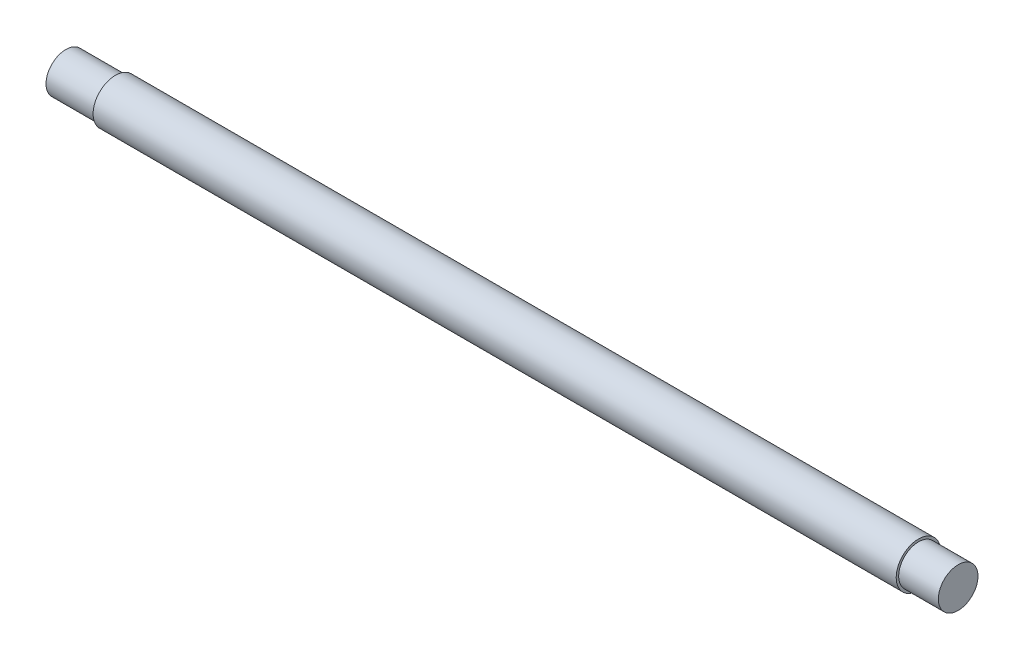
ISO-10303-21;
HEADER;
FILE_DESCRIPTION(('STEP AP214'),'2;1');
FILE_NAME('part.step','',(''),(''),'','','');
FILE_SCHEMA(('AUTOMOTIVE_DESIGN { 1 0 10303 214 1 1 1 1 }'));
ENDSEC;
DATA;
#1=APPLICATION_CONTEXT('core data for automotive mechanical design processes');
#2=APPLICATION_PROTOCOL_DEFINITION('international standard','automotive_design',2000,#1);
#3=PRODUCT_CONTEXT('',#1,'mechanical');
#4=PRODUCT('Part','Part','',(#3));
#5=PRODUCT_RELATED_PRODUCT_CATEGORY('part','',(#4));
#6=PRODUCT_DEFINITION_FORMATION('','',#4);
#7=PRODUCT_DEFINITION_CONTEXT('part definition',#1,'design');
#8=PRODUCT_DEFINITION('design','',#6,#7);
#9=PRODUCT_DEFINITION_SHAPE('','',#8);
#10=(LENGTH_UNIT() NAMED_UNIT(*) SI_UNIT(.MILLI.,.METRE.));
#11=(NAMED_UNIT(*) PLANE_ANGLE_UNIT() SI_UNIT($,.RADIAN.));
#12=(NAMED_UNIT(*) SI_UNIT($,.STERADIAN.) SOLID_ANGLE_UNIT());
#13=UNCERTAINTY_MEASURE_WITH_UNIT(LENGTH_MEASURE(1.E-05),#10,'distance_accuracy_value','');
#14=(GEOMETRIC_REPRESENTATION_CONTEXT(3) GLOBAL_UNCERTAINTY_ASSIGNED_CONTEXT((#13)) GLOBAL_UNIT_ASSIGNED_CONTEXT((#10,
#11,#12)) REPRESENTATION_CONTEXT('',''));
#15=CARTESIAN_POINT('',(0.,0.,0.));
#16=DIRECTION('',(0.,0.,1.));
#17=DIRECTION('',(1.,0.,0.));
#18=AXIS2_PLACEMENT_3D('',#15,#16,#17);
#19=CARTESIAN_POINT('',(45.,0.,0.));
#20=DIRECTION('',(-1.,0.,0.));
#21=DIRECTION('',(0.,0.,1.));
#22=AXIS2_PLACEMENT_3D('',#19,#20,#21);
#23=CYLINDRICAL_SURFACE('',#22,2.25);
#24=CARTESIAN_POINT('',(41.,0.,0.));
#25=DIRECTION('',(1.,0.,0.));
#26=DIRECTION('',(0.,0.,-1.));
#27=AXIS2_PLACEMENT_3D('',#24,#25,#26);
#28=CIRCLE('',#27,2.25);
#29=CARTESIAN_POINT('',(41.,0.,-2.25));
#30=VERTEX_POINT('',#29);
#31=EDGE_CURVE('E10',#30,#30,#28,.T.);
#32=ORIENTED_EDGE('',*,*,#31,.F.);
#33=EDGE_LOOP('',(#32));
#34=FACE_BOUND('',#33,.T.);
#35=CARTESIAN_POINT('',(-40.,0.,0.));
#36=DIRECTION('',(-1.,0.,0.));
#37=DIRECTION('',(0.,0.,1.));
#38=AXIS2_PLACEMENT_3D('',#35,#36,#37);
#39=CIRCLE('',#38,2.25);
#40=CARTESIAN_POINT('',(-40.,0.,2.25));
#41=VERTEX_POINT('',#40);
#42=EDGE_CURVE('E59',#41,#41,#39,.T.);
#43=ORIENTED_EDGE('',*,*,#42,.F.);
#44=EDGE_LOOP('',(#43));
#45=FACE_BOUND('',#44,.T.);
#46=ADVANCED_FACE('F41',(#34,#45),#23,.T.);
#47=CARTESIAN_POINT('',(41.,0.,0.));
#48=DIRECTION('',(1.,0.,0.));
#49=DIRECTION('',(0.,0.,-1.));
#50=AXIS2_PLACEMENT_3D('',#47,#48,#49);
#51=PLANE('',#50);
#52=CARTESIAN_POINT('',(41.,0.,0.));
#53=DIRECTION('',(1.,0.,0.));
#54=DIRECTION('',(0.,0.,-1.));
#55=AXIS2_PLACEMENT_3D('',#52,#53,#54);
#56=CIRCLE('',#55,2.);
#57=CARTESIAN_POINT('',(41.,0.,-2.));
#58=VERTEX_POINT('',#57);
#59=EDGE_CURVE('E48',#58,#58,#56,.T.);
#60=ORIENTED_EDGE('',*,*,#59,.F.);
#61=EDGE_LOOP('',(#60));
#62=FACE_BOUND('',#61,.T.);
#63=ORIENTED_EDGE('',*,*,#31,.T.);
#64=EDGE_LOOP('',(#63));
#65=FACE_BOUND('',#64,.T.);
#66=ADVANCED_FACE('F84',(#62,#65),#51,.T.);
#67=CARTESIAN_POINT('',(41.,0.,0.));
#68=DIRECTION('',(1.,0.,0.));
#69=DIRECTION('',(0.,0.,-1.));
#70=AXIS2_PLACEMENT_3D('',#67,#68,#69);
#71=CYLINDRICAL_SURFACE('',#70,2.);
#72=ORIENTED_EDGE('',*,*,#59,.T.);
#73=EDGE_LOOP('',(#72));
#74=FACE_BOUND('',#73,.T.);
#75=CARTESIAN_POINT('',(45.,0.,0.));
#76=DIRECTION('',(1.,0.,0.));
#77=DIRECTION('',(0.,0.,-1.));
#78=AXIS2_PLACEMENT_3D('',#75,#76,#77);
#79=CIRCLE('',#78,2.);
#80=CARTESIAN_POINT('',(45.,0.,-2.));
#81=VERTEX_POINT('',#80);
#82=EDGE_CURVE('E53',#81,#81,#79,.T.);
#83=ORIENTED_EDGE('',*,*,#82,.F.);
#84=EDGE_LOOP('',(#83));
#85=FACE_BOUND('',#84,.T.);
#86=ADVANCED_FACE('F89',(#74,#85),#71,.T.);
#87=CARTESIAN_POINT('',(45.,0.,0.));
#88=DIRECTION('',(1.,0.,0.));
#89=DIRECTION('',(0.,0.,-1.));
#90=AXIS2_PLACEMENT_3D('',#87,#88,#89);
#91=PLANE('',#90);
#92=ORIENTED_EDGE('',*,*,#82,.T.);
#93=EDGE_LOOP('',(#92));
#94=FACE_BOUND('',#93,.T.);
#95=ADVANCED_FACE('F79',(#94),#91,.T.);
#96=CARTESIAN_POINT('',(-40.,0.,0.));
#97=DIRECTION('',(-1.,0.,0.));
#98=DIRECTION('',(0.,0.,1.));
#99=AXIS2_PLACEMENT_3D('',#96,#97,#98);
#100=PLANE('',#99);
#101=CARTESIAN_POINT('',(-40.,0.,0.));
#102=DIRECTION('',(-1.,0.,0.));
#103=DIRECTION('',(0.,0.,1.));
#104=AXIS2_PLACEMENT_3D('',#101,#102,#103);
#105=CIRCLE('',#104,2.);
#106=CARTESIAN_POINT('',(-40.,0.,2.));
#107=VERTEX_POINT('',#106);
#108=EDGE_CURVE('E64',#107,#107,#105,.T.);
#109=ORIENTED_EDGE('',*,*,#108,.F.);
#110=EDGE_LOOP('',(#109));
#111=FACE_BOUND('',#110,.T.);
#112=ORIENTED_EDGE('',*,*,#42,.T.);
#113=EDGE_LOOP('',(#112));
#114=FACE_BOUND('',#113,.T.);
#115=ADVANCED_FACE('F76',(#111,#114),#100,.T.);
#116=CARTESIAN_POINT('',(-40.,0.,0.));
#117=DIRECTION('',(-1.,0.,0.));
#118=DIRECTION('',(0.,0.,1.));
#119=AXIS2_PLACEMENT_3D('',#116,#117,#118);
#120=CYLINDRICAL_SURFACE('',#119,2.);
#121=ORIENTED_EDGE('',*,*,#108,.T.);
#122=EDGE_LOOP('',(#121));
#123=FACE_BOUND('',#122,.T.);
#124=CARTESIAN_POINT('',(-45.,0.,0.));
#125=DIRECTION('',(-1.,0.,0.));
#126=DIRECTION('',(0.,0.,1.));
#127=AXIS2_PLACEMENT_3D('',#124,#125,#126);
#128=CIRCLE('',#127,2.);
#129=CARTESIAN_POINT('',(-45.,0.,2.));
#130=VERTEX_POINT('',#129);
#131=EDGE_CURVE('E65',#130,#130,#128,.T.);
#132=ORIENTED_EDGE('',*,*,#131,.F.);
#133=EDGE_LOOP('',(#132));
#134=FACE_BOUND('',#133,.T.);
#135=ADVANCED_FACE('F73',(#123,#134),#120,.T.);
#136=CARTESIAN_POINT('',(-45.,0.,0.));
#137=DIRECTION('',(1.,0.,0.));
#138=DIRECTION('',(0.,0.,-1.));
#139=AXIS2_PLACEMENT_3D('',#136,#137,#138);
#140=PLANE('',#139);
#141=ORIENTED_EDGE('',*,*,#131,.T.);
#142=EDGE_LOOP('',(#141));
#143=FACE_BOUND('',#142,.T.);
#144=ADVANCED_FACE('F99',(#143),#140,.F.);
#145=CLOSED_SHELL('',(#46,#66,#86,#95,#115,#135,#144));
#146=MANIFOLD_SOLID_BREP('B2',#145);
#147=ADVANCED_BREP_SHAPE_REPRESENTATION('',(#18,#146),#14);
#148=SHAPE_DEFINITION_REPRESENTATION(#9,#147);
ENDSEC;
END-ISO-10303-21;
